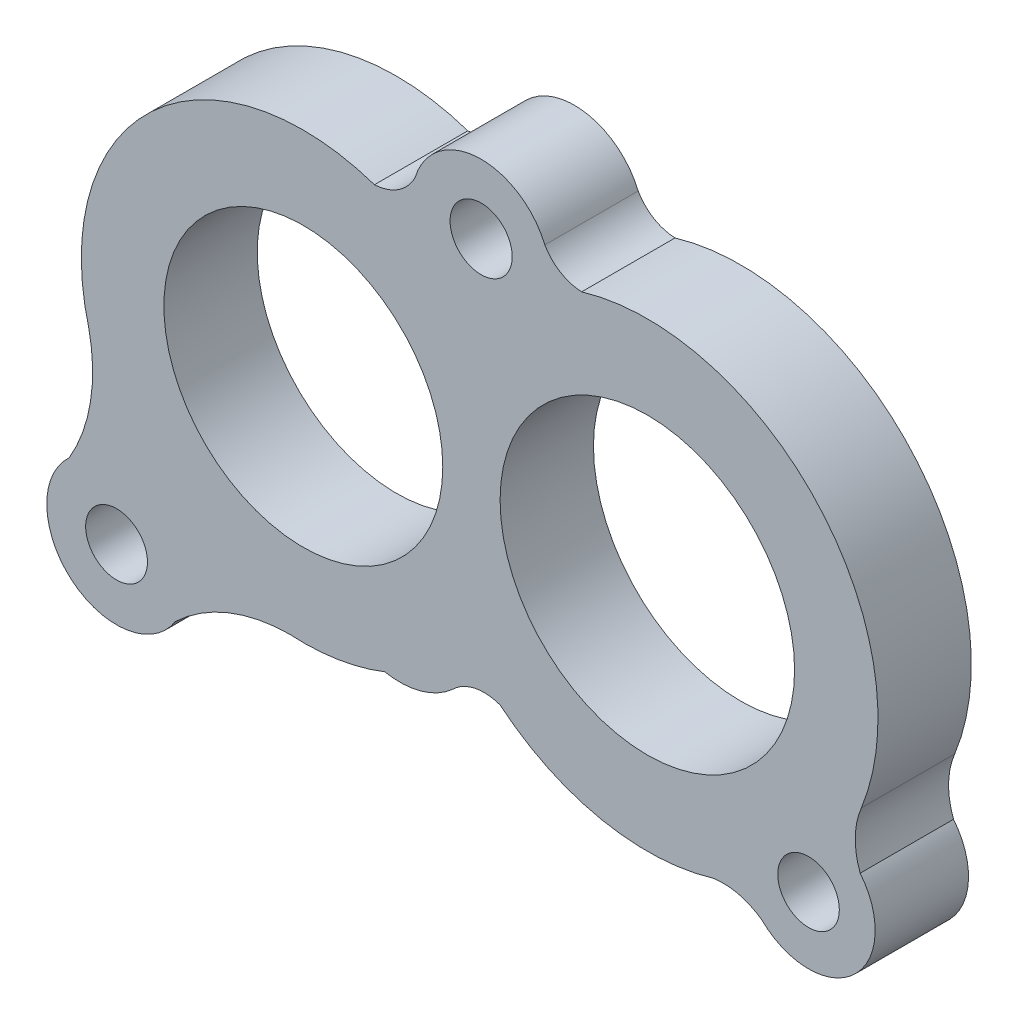
ISO-10303-21;
HEADER;
FILE_DESCRIPTION(('STEP AP214'),'2;1');
FILE_NAME('part.step','',(''),(''),'','','');
FILE_SCHEMA(('AUTOMOTIVE_DESIGN { 1 0 10303 214 1 1 1 1 }'));
ENDSEC;
DATA;
#1=APPLICATION_CONTEXT('core data for automotive mechanical design processes');
#2=APPLICATION_PROTOCOL_DEFINITION('international standard','automotive_design',2000,#1);
#3=PRODUCT_CONTEXT('',#1,'mechanical');
#4=PRODUCT('Part','Part','',(#3));
#5=PRODUCT_RELATED_PRODUCT_CATEGORY('part','',(#4));
#6=PRODUCT_DEFINITION_FORMATION('','',#4);
#7=PRODUCT_DEFINITION_CONTEXT('part definition',#1,'design');
#8=PRODUCT_DEFINITION('design','',#6,#7);
#9=PRODUCT_DEFINITION_SHAPE('','',#8);
#10=(LENGTH_UNIT() NAMED_UNIT(*) SI_UNIT(.MILLI.,.METRE.));
#11=(NAMED_UNIT(*) PLANE_ANGLE_UNIT() SI_UNIT($,.RADIAN.));
#12=(NAMED_UNIT(*) SI_UNIT($,.STERADIAN.) SOLID_ANGLE_UNIT());
#13=UNCERTAINTY_MEASURE_WITH_UNIT(LENGTH_MEASURE(1.E-05),#10,'distance_accuracy_value','');
#14=(GEOMETRIC_REPRESENTATION_CONTEXT(3) GLOBAL_UNCERTAINTY_ASSIGNED_CONTEXT((#13)) GLOBAL_UNIT_ASSIGNED_CONTEXT((#10,
#11,#12)) REPRESENTATION_CONTEXT('',''));
#15=CARTESIAN_POINT('',(0.,0.,0.));
#16=DIRECTION('',(0.,0.,1.));
#17=DIRECTION('',(1.,0.,0.));
#18=AXIS2_PLACEMENT_3D('',#15,#16,#17);
#19=CARTESIAN_POINT('',(1150.32510035845,671.005058170759,10.));
#20=DIRECTION('',(0.,0.,-1.));
#21=DIRECTION('',(-1.,0.,0.));
#22=AXIS2_PLACEMENT_3D('',#19,#20,#21);
#23=CYLINDRICAL_SURFACE('',#22,17.9040012040854);
#24=CARTESIAN_POINT('',(1150.32510035845,671.005058170759,0.));
#25=DIRECTION('',(0.,0.,1.));
#26=DIRECTION('',(1.,0.,0.));
#27=AXIS2_PLACEMENT_3D('',#24,#25,#26);
#28=CIRCLE('',#27,17.9040012040854);
#29=CARTESIAN_POINT('',(1137.98627586492,683.978364196356,0.));
#30=VERTEX_POINT('',#29);
#31=CARTESIAN_POINT('',(1150.19162726811,688.908561851605,0.));
#32=VERTEX_POINT('',#31);
#33=EDGE_CURVE('E201',#30,#32,#28,.F.);
#34=ORIENTED_EDGE('',*,*,#33,.T.);
#35=DIRECTION('',(0.,0.,-1.));
#36=VECTOR('',#35,1.);
#37=CARTESIAN_POINT('',(1150.19162726811,688.908561851605,10.));
#38=LINE('',#37,#36);
#39=CARTESIAN_POINT('',(1150.19162726811,688.908561851605,10.));
#40=VERTEX_POINT('',#39);
#41=EDGE_CURVE('E11',#40,#32,#38,.T.);
#42=ORIENTED_EDGE('',*,*,#41,.F.);
#43=CARTESIAN_POINT('',(1150.32510035845,671.005058170759,10.));
#44=DIRECTION('',(0.,0.,1.));
#45=DIRECTION('',(1.,0.,0.));
#46=AXIS2_PLACEMENT_3D('',#43,#44,#45);
#47=CIRCLE('',#46,17.9040012040854);
#48=CARTESIAN_POINT('',(1137.98627586492,683.978364196356,10.));
#49=VERTEX_POINT('',#48);
#50=EDGE_CURVE('E347',#49,#40,#47,.F.);
#51=ORIENTED_EDGE('',*,*,#50,.F.);
#52=DIRECTION('',(0.,0.,-1.));
#53=VECTOR('',#52,1.);
#54=CARTESIAN_POINT('',(1137.98627586492,683.978364196356,10.));
#55=LINE('',#54,#53);
#56=EDGE_CURVE('E177',#49,#30,#55,.T.);
#57=ORIENTED_EDGE('',*,*,#56,.T.);
#58=EDGE_LOOP('',(#34,#42,#51,#57));
#59=FACE_BOUND('',#58,.T.);
#60=ADVANCED_FACE('F39',(#59),#23,.F.);
#61=CARTESIAN_POINT('',(1151.68513690213,712.630466954228,10.));
#62=DIRECTION('',(0.,0.,-1.));
#63=DIRECTION('',(-1.,0.,0.));
#64=AXIS2_PLACEMENT_3D('',#61,#62,#63);
#65=CYLINDRICAL_SURFACE('',#64,23.7688736107712);
#66=CARTESIAN_POINT('',(1151.68513690213,712.630466954228,0.));
#67=DIRECTION('',(0.,0.,1.));
#68=DIRECTION('',(1.,0.,0.));
#69=AXIS2_PLACEMENT_3D('',#66,#67,#68);
#70=CIRCLE('',#69,23.7688736107712);
#71=CARTESIAN_POINT('',(1160.40529023957,690.518970431006,0.));
#72=VERTEX_POINT('',#71);
#73=EDGE_CURVE('E205',#32,#72,#70,.T.);
#74=ORIENTED_EDGE('',*,*,#73,.T.);
#75=DIRECTION('',(0.,0.,-1.));
#76=VECTOR('',#75,1.);
#77=CARTESIAN_POINT('',(1160.40529023957,690.518970431006,10.));
#78=LINE('',#77,#76);
#79=CARTESIAN_POINT('',(1160.40529023957,690.518970431006,10.));
#80=VERTEX_POINT('',#79);
#81=EDGE_CURVE('E49',#80,#72,#78,.T.);
#82=ORIENTED_EDGE('',*,*,#81,.F.);
#83=CARTESIAN_POINT('',(1151.68513690213,712.630466954228,10.));
#84=DIRECTION('',(0.,0.,1.));
#85=DIRECTION('',(1.,0.,0.));
#86=AXIS2_PLACEMENT_3D('',#83,#84,#85);
#87=CIRCLE('',#86,23.7688736107712);
#88=EDGE_CURVE('E117',#40,#80,#87,.T.);
#89=ORIENTED_EDGE('',*,*,#88,.F.);
#90=ORIENTED_EDGE('',*,*,#41,.T.);
#91=EDGE_LOOP('',(#74,#82,#89,#90));
#92=FACE_BOUND('',#91,.T.);
#93=ADVANCED_FACE('F362',(#92),#65,.T.);
#94=CARTESIAN_POINT('',(1162.02492960815,698.806449295897,10.));
#95=DIRECTION('',(0.,0.,-1.));
#96=DIRECTION('',(-1.,0.,0.));
#97=AXIS2_PLACEMENT_3D('',#94,#95,#96);
#98=CYLINDRICAL_SURFACE('',#97,8.44426063194722);
#99=CARTESIAN_POINT('',(1162.02492960815,698.806449295897,0.));
#100=DIRECTION('',(0.,0.,1.));
#101=DIRECTION('',(1.,0.,0.));
#102=AXIS2_PLACEMENT_3D('',#99,#100,#101);
#103=CIRCLE('',#102,8.44426063194722);
#104=CARTESIAN_POINT('',(1167.67531976915,692.531209965905,0.));
#105=VERTEX_POINT('',#104);
#106=EDGE_CURVE('E208',#72,#105,#103,.T.);
#107=ORIENTED_EDGE('',*,*,#106,.T.);
#108=DIRECTION('',(0.,0.,-1.));
#109=VECTOR('',#108,1.);
#110=CARTESIAN_POINT('',(1167.67531976915,692.531209965905,10.));
#111=LINE('',#110,#109);
#112=CARTESIAN_POINT('',(1167.67531976915,692.531209965905,10.));
#113=VERTEX_POINT('',#112);
#114=EDGE_CURVE('E285',#113,#105,#111,.T.);
#115=ORIENTED_EDGE('',*,*,#114,.F.);
#116=CARTESIAN_POINT('',(1162.02492960815,698.806449295897,10.));
#117=DIRECTION('',(0.,0.,1.));
#118=DIRECTION('',(1.,0.,0.));
#119=AXIS2_PLACEMENT_3D('',#116,#117,#118);
#120=CIRCLE('',#119,8.44426063194722);
#121=EDGE_CURVE('E295',#80,#113,#120,.T.);
#122=ORIENTED_EDGE('',*,*,#121,.F.);
#123=ORIENTED_EDGE('',*,*,#81,.T.);
#124=EDGE_LOOP('',(#107,#115,#122,#123));
#125=FACE_BOUND('',#124,.T.);
#126=ADVANCED_FACE('F293',(#125),#98,.T.);
#127=CARTESIAN_POINT('',(1171.07117350967,689.091245871374,10.));
#128=DIRECTION('',(0.,0.,-1.));
#129=DIRECTION('',(-1.,0.,0.));
#130=AXIS2_PLACEMENT_3D('',#127,#128,#129);
#131=CYLINDRICAL_SURFACE('',#130,4.83375377927274);
#132=CARTESIAN_POINT('',(1171.07117350967,689.091245871374,0.));
#133=DIRECTION('',(0.,0.,1.));
#134=DIRECTION('',(1.,0.,0.));
#135=AXIS2_PLACEMENT_3D('',#132,#133,#134);
#136=CIRCLE('',#135,4.83375377927274);
#137=CARTESIAN_POINT('',(1172.76393969169,693.618907326433,0.));
#138=VERTEX_POINT('',#137);
#139=EDGE_CURVE('E211',#105,#138,#136,.F.);
#140=ORIENTED_EDGE('',*,*,#139,.T.);
#141=DIRECTION('',(0.,0.,-1.));
#142=VECTOR('',#141,1.);
#143=CARTESIAN_POINT('',(1172.76393969169,693.618907326433,10.));
#144=LINE('',#143,#142);
#145=CARTESIAN_POINT('',(1172.76393969169,693.618907326433,10.));
#146=VERTEX_POINT('',#145);
#147=EDGE_CURVE('E281',#146,#138,#144,.T.);
#148=ORIENTED_EDGE('',*,*,#147,.F.);
#149=CARTESIAN_POINT('',(1171.07117350967,689.091245871374,10.));
#150=DIRECTION('',(0.,0.,1.));
#151=DIRECTION('',(1.,0.,0.));
#152=AXIS2_PLACEMENT_3D('',#149,#150,#151);
#153=CIRCLE('',#152,4.83375377927274);
#154=EDGE_CURVE('E314',#113,#146,#153,.F.);
#155=ORIENTED_EDGE('',*,*,#154,.F.);
#156=ORIENTED_EDGE('',*,*,#114,.T.);
#157=EDGE_LOOP('',(#140,#148,#155,#156));
#158=FACE_BOUND('',#157,.T.);
#159=ADVANCED_FACE('F304',(#158),#131,.F.);
#160=CARTESIAN_POINT('',(1188.53901056711,712.636857749028,10.));
#161=DIRECTION('',(0.,0.,-1.));
#162=DIRECTION('',(-1.,0.,0.));
#163=AXIS2_PLACEMENT_3D('',#160,#161,#162);
#164=CYLINDRICAL_SURFACE('',#163,24.7090125136688);
#165=CARTESIAN_POINT('',(1188.53901056711,712.636857749028,0.));
#166=DIRECTION('',(0.,0.,1.));
#167=DIRECTION('',(1.,0.,0.));
#168=AXIS2_PLACEMENT_3D('',#165,#166,#167);
#169=CIRCLE('',#168,24.7090125136688);
#170=CARTESIAN_POINT('',(1195.63007830381,688.967213523689,0.));
#171=VERTEX_POINT('',#170);
#172=EDGE_CURVE('E214',#138,#171,#169,.T.);
#173=ORIENTED_EDGE('',*,*,#172,.T.);
#174=DIRECTION('',(0.,0.,-1.));
#175=VECTOR('',#174,1.);
#176=CARTESIAN_POINT('',(1195.63007830381,688.967213523689,10.));
#177=LINE('',#176,#175);
#178=CARTESIAN_POINT('',(1195.63007830381,688.967213523689,10.));
#179=VERTEX_POINT('',#178);
#180=EDGE_CURVE('E277',#179,#171,#177,.T.);
#181=ORIENTED_EDGE('',*,*,#180,.F.);
#182=CARTESIAN_POINT('',(1188.53901056711,712.636857749028,10.));
#183=DIRECTION('',(0.,0.,1.));
#184=DIRECTION('',(1.,0.,0.));
#185=AXIS2_PLACEMENT_3D('',#182,#183,#184);
#186=CIRCLE('',#185,24.7090125136688);
#187=EDGE_CURVE('E310',#146,#179,#186,.T.);
#188=ORIENTED_EDGE('',*,*,#187,.F.);
#189=ORIENTED_EDGE('',*,*,#147,.T.);
#190=EDGE_LOOP('',(#173,#181,#188,#189));
#191=FACE_BOUND('',#190,.T.);
#192=ADVANCED_FACE('F308',(#191),#164,.T.);
#193=CARTESIAN_POINT('',(1196.66412017446,682.017688146015,10.));
#194=DIRECTION('',(0.,0.,-1.));
#195=DIRECTION('',(-1.,0.,0.));
#196=AXIS2_PLACEMENT_3D('',#193,#194,#195);
#197=CYLINDRICAL_SURFACE('',#196,7.02603341617303);
#198=CARTESIAN_POINT('',(1196.66412017446,682.017688146015,0.));
#199=DIRECTION('',(0.,0.,1.));
#200=DIRECTION('',(1.,0.,0.));
#201=AXIS2_PLACEMENT_3D('',#198,#199,#200);
#202=CIRCLE('',#201,7.02603341617303);
#203=CARTESIAN_POINT('',(1200.81906226093,687.683515695742,0.));
#204=VERTEX_POINT('',#203);
#205=EDGE_CURVE('E217',#171,#204,#202,.F.);
#206=ORIENTED_EDGE('',*,*,#205,.T.);
#207=DIRECTION('',(0.,0.,-1.));
#208=VECTOR('',#207,1.);
#209=CARTESIAN_POINT('',(1200.81906226093,687.683515695742,10.));
#210=LINE('',#209,#208);
#211=CARTESIAN_POINT('',(1200.81906226093,687.683515695742,10.));
#212=VERTEX_POINT('',#211);
#213=EDGE_CURVE('E273',#212,#204,#210,.T.);
#214=ORIENTED_EDGE('',*,*,#213,.F.);
#215=CARTESIAN_POINT('',(1196.66412017446,682.017688146015,10.));
#216=DIRECTION('',(0.,0.,1.));
#217=DIRECTION('',(1.,0.,0.));
#218=AXIS2_PLACEMENT_3D('',#215,#216,#217);
#219=CIRCLE('',#218,7.02603341617303);
#220=EDGE_CURVE('E313',#179,#212,#219,.F.);
#221=ORIENTED_EDGE('',*,*,#220,.F.);
#222=ORIENTED_EDGE('',*,*,#180,.T.);
#223=EDGE_LOOP('',(#206,#214,#221,#222));
#224=FACE_BOUND('',#223,.T.);
#225=ADVANCED_FACE('F515',(#224),#197,.F.);
#226=CARTESIAN_POINT('',(1205.80734896864,692.791475028512,10.));
#227=DIRECTION('',(0.,0.,-1.));
#228=DIRECTION('',(-1.,0.,0.));
#229=AXIS2_PLACEMENT_3D('',#226,#227,#228);
#230=CYLINDRICAL_SURFACE('',#229,7.13962553804877);
#231=CARTESIAN_POINT('',(1205.80734896864,692.791475028512,0.));
#232=DIRECTION('',(0.,0.,1.));
#233=DIRECTION('',(1.,0.,0.));
#234=AXIS2_PLACEMENT_3D('',#231,#232,#233);
#235=CIRCLE('',#234,7.13962553804877);
#236=CARTESIAN_POINT('',(1211.34053526821,697.303470396182,0.));
#237=VERTEX_POINT('',#236);
#238=EDGE_CURVE('E220',#204,#237,#235,.T.);
#239=ORIENTED_EDGE('',*,*,#238,.T.);
#240=DIRECTION('',(0.,0.,-1.));
#241=VECTOR('',#240,1.);
#242=CARTESIAN_POINT('',(1211.34053526821,697.303470396182,10.));
#243=LINE('',#242,#241);
#244=CARTESIAN_POINT('',(1211.34053526821,697.303470396182,10.));
#245=VERTEX_POINT('',#244);
#246=EDGE_CURVE('E270',#245,#237,#243,.T.);
#247=ORIENTED_EDGE('',*,*,#246,.F.);
#248=CARTESIAN_POINT('',(1205.80734896864,692.791475028512,10.));
#249=DIRECTION('',(0.,0.,1.));
#250=DIRECTION('',(1.,0.,0.));
#251=AXIS2_PLACEMENT_3D('',#248,#249,#250);
#252=CIRCLE('',#251,7.13962553804877);
#253=EDGE_CURVE('E318',#212,#245,#252,.T.);
#254=ORIENTED_EDGE('',*,*,#253,.F.);
#255=ORIENTED_EDGE('',*,*,#213,.T.);
#256=EDGE_LOOP('',(#239,#247,#254,#255));
#257=FACE_BOUND('',#256,.T.);
#258=ADVANCED_FACE('F505',(#257),#230,.T.);
#259=CARTESIAN_POINT('',(1219.01373410297,700.207501801095,10.));
#260=DIRECTION('',(0.,0.,-1.));
#261=DIRECTION('',(-1.,0.,0.));
#262=AXIS2_PLACEMENT_3D('',#259,#260,#261);
#263=CYLINDRICAL_SURFACE('',#262,8.20435120887146);
#264=CARTESIAN_POINT('',(1219.01373410297,700.207501801095,0.));
#265=DIRECTION('',(0.,0.,1.));
#266=DIRECTION('',(1.,0.,0.));
#267=AXIS2_PLACEMENT_3D('',#264,#265,#266);
#268=CIRCLE('',#267,8.20435120887146);
#269=CARTESIAN_POINT('',(1211.46742420019,703.426909449982,0.));
#270=VERTEX_POINT('',#269);
#271=EDGE_CURVE('E224',#270,#237,#268,.T.);
#272=ORIENTED_EDGE('',*,*,#271,.F.);
#273=DIRECTION('',(0.,0.,-1.));
#274=VECTOR('',#273,1.);
#275=CARTESIAN_POINT('',(1211.46742420019,703.426909449982,10.));
#276=LINE('',#275,#274);
#277=CARTESIAN_POINT('',(1211.46742420019,703.426909449982,10.));
#278=VERTEX_POINT('',#277);
#279=EDGE_CURVE('E267',#278,#270,#276,.T.);
#280=ORIENTED_EDGE('',*,*,#279,.F.);
#281=CARTESIAN_POINT('',(1219.01373410297,700.207501801095,10.));
#282=DIRECTION('',(0.,0.,1.));
#283=DIRECTION('',(1.,0.,0.));
#284=AXIS2_PLACEMENT_3D('',#281,#282,#283);
#285=CIRCLE('',#284,8.20435120887146);
#286=EDGE_CURVE('E325',#278,#245,#285,.T.);
#287=ORIENTED_EDGE('',*,*,#286,.T.);
#288=ORIENTED_EDGE('',*,*,#246,.T.);
#289=EDGE_LOOP('',(#272,#280,#287,#288));
#290=FACE_BOUND('',#289,.T.);
#291=ADVANCED_FACE('F495',(#290),#263,.F.);
#292=CARTESIAN_POINT('',(1188.53901056711,712.636857749028,10.));
#293=DIRECTION('',(0.,0.,-1.));
#294=DIRECTION('',(-1.,0.,0.));
#295=AXIS2_PLACEMENT_3D('',#292,#293,#294);
#296=CYLINDRICAL_SURFACE('',#295,24.7090125136689);
#297=CARTESIAN_POINT('',(1188.53901056711,712.636857749028,0.));
#298=DIRECTION('',(0.,0.,1.));
#299=DIRECTION('',(1.,0.,0.));
#300=AXIS2_PLACEMENT_3D('',#297,#298,#299);
#301=CIRCLE('',#300,24.7090125136689);
#302=CARTESIAN_POINT('',(1181.50669309383,736.324023268686,0.));
#303=VERTEX_POINT('',#302);
#304=EDGE_CURVE('E228',#270,#303,#301,.T.);
#305=ORIENTED_EDGE('',*,*,#304,.T.);
#306=DIRECTION('',(0.,0.,-1.));
#307=VECTOR('',#306,1.);
#308=CARTESIAN_POINT('',(1181.50669309383,736.324023268686,10.));
#309=LINE('',#308,#307);
#310=CARTESIAN_POINT('',(1181.50669309383,736.324023268686,10.));
#311=VERTEX_POINT('',#310);
#312=EDGE_CURVE('E264',#311,#303,#309,.T.);
#313=ORIENTED_EDGE('',*,*,#312,.F.);
#314=CARTESIAN_POINT('',(1188.53901056711,712.636857749028,10.));
#315=DIRECTION('',(0.,0.,1.));
#316=DIRECTION('',(1.,0.,0.));
#317=AXIS2_PLACEMENT_3D('',#314,#315,#316);
#318=CIRCLE('',#317,24.7090125136689);
#319=EDGE_CURVE('E329',#278,#311,#318,.T.);
#320=ORIENTED_EDGE('',*,*,#319,.F.);
#321=ORIENTED_EDGE('',*,*,#279,.T.);
#322=EDGE_LOOP('',(#305,#313,#320,#321));
#323=FACE_BOUND('',#322,.T.);
#324=ADVANCED_FACE('F485',(#323),#296,.T.);
#325=CARTESIAN_POINT('',(1181.65962833516,741.044686673339,10.));
#326=DIRECTION('',(0.,0.,-1.));
#327=DIRECTION('',(-1.,0.,0.));
#328=AXIS2_PLACEMENT_3D('',#325,#326,#327);
#329=CYLINDRICAL_SURFACE('',#328,4.72314007500074);
#330=CARTESIAN_POINT('',(1181.65962833516,741.044686673339,0.));
#331=DIRECTION('',(0.,0.,1.));
#332=DIRECTION('',(1.,0.,0.));
#333=AXIS2_PLACEMENT_3D('',#330,#331,#332);
#334=CIRCLE('',#333,4.72314007500074);
#335=CARTESIAN_POINT('',(1177.55897741406,738.701032647827,0.));
#336=VERTEX_POINT('',#335);
#337=EDGE_CURVE('E232',#336,#303,#334,.T.);
#338=ORIENTED_EDGE('',*,*,#337,.F.);
#339=DIRECTION('',(0.,0.,-1.));
#340=VECTOR('',#339,1.);
#341=CARTESIAN_POINT('',(1177.55897741406,738.701032647827,10.));
#342=LINE('',#341,#340);
#343=CARTESIAN_POINT('',(1177.55897741406,738.701032647827,10.));
#344=VERTEX_POINT('',#343);
#345=EDGE_CURVE('E261',#344,#336,#342,.T.);
#346=ORIENTED_EDGE('',*,*,#345,.F.);
#347=CARTESIAN_POINT('',(1181.65962833516,741.044686673339,10.));
#348=DIRECTION('',(0.,0.,1.));
#349=DIRECTION('',(1.,0.,0.));
#350=AXIS2_PLACEMENT_3D('',#347,#348,#349);
#351=CIRCLE('',#350,4.72314007500074);
#352=EDGE_CURVE('E332',#344,#311,#351,.T.);
#353=ORIENTED_EDGE('',*,*,#352,.T.);
#354=ORIENTED_EDGE('',*,*,#312,.T.);
#355=EDGE_LOOP('',(#338,#346,#353,#354));
#356=FACE_BOUND('',#355,.T.);
#357=ADVANCED_FACE('F475',(#356),#329,.F.);
#358=CARTESIAN_POINT('',(1170.73289448136,735.852853522064,10.));
#359=DIRECTION('',(0.,0.,-1.));
#360=DIRECTION('',(-1.,0.,0.));
#361=AXIS2_PLACEMENT_3D('',#358,#359,#360);
#362=CYLINDRICAL_SURFACE('',#361,7.39645405153341);
#363=CARTESIAN_POINT('',(1170.73289448136,735.852853522064,0.));
#364=DIRECTION('',(0.,0.,1.));
#365=DIRECTION('',(1.,0.,0.));
#366=AXIS2_PLACEMENT_3D('',#363,#364,#365);
#367=CIRCLE('',#366,7.39645405153341);
#368=CARTESIAN_POINT('',(1163.64359288161,737.962198293356,0.));
#369=VERTEX_POINT('',#368);
#370=EDGE_CURVE('E236',#336,#369,#367,.T.);
#371=ORIENTED_EDGE('',*,*,#370,.T.);
#372=DIRECTION('',(0.,0.,-1.));
#373=VECTOR('',#372,1.);
#374=CARTESIAN_POINT('',(1163.64359288161,737.962198293356,10.));
#375=LINE('',#374,#373);
#376=CARTESIAN_POINT('',(1163.64359288161,737.962198293356,10.));
#377=VERTEX_POINT('',#376);
#378=EDGE_CURVE('E258',#377,#369,#375,.T.);
#379=ORIENTED_EDGE('',*,*,#378,.F.);
#380=CARTESIAN_POINT('',(1170.73289448136,735.852853522064,10.));
#381=DIRECTION('',(0.,0.,1.));
#382=DIRECTION('',(1.,0.,0.));
#383=AXIS2_PLACEMENT_3D('',#380,#381,#382);
#384=CIRCLE('',#383,7.39645405153341);
#385=EDGE_CURVE('E336',#344,#377,#384,.T.);
#386=ORIENTED_EDGE('',*,*,#385,.F.);
#387=ORIENTED_EDGE('',*,*,#345,.T.);
#388=EDGE_LOOP('',(#371,#379,#386,#387));
#389=FACE_BOUND('',#388,.T.);
#390=ADVANCED_FACE('F466',(#389),#362,.T.);
#391=CARTESIAN_POINT('',(1159.05533710948,740.302656156215,10.));
#392=DIRECTION('',(0.,0.,-1.));
#393=DIRECTION('',(-1.,0.,0.));
#394=AXIS2_PLACEMENT_3D('',#391,#392,#393);
#395=CYLINDRICAL_SURFACE('',#394,5.15071199333696);
#396=CARTESIAN_POINT('',(1159.05533710948,740.302656156215,0.));
#397=DIRECTION('',(0.,0.,1.));
#398=DIRECTION('',(1.,0.,0.));
#399=AXIS2_PLACEMENT_3D('',#396,#397,#398);
#400=CIRCLE('',#399,5.15071199333696);
#401=CARTESIAN_POINT('',(1159.30385985549,735.157943289298,0.));
#402=VERTEX_POINT('',#401);
#403=EDGE_CURVE('E240',#402,#369,#400,.T.);
#404=ORIENTED_EDGE('',*,*,#403,.F.);
#405=DIRECTION('',(0.,0.,-1.));
#406=VECTOR('',#405,1.);
#407=CARTESIAN_POINT('',(1159.30385985549,735.157943289298,10.));
#408=LINE('',#407,#406);
#409=CARTESIAN_POINT('',(1159.30385985549,735.157943289298,10.));
#410=VERTEX_POINT('',#409);
#411=EDGE_CURVE('E171',#410,#402,#408,.T.);
#412=ORIENTED_EDGE('',*,*,#411,.F.);
#413=CARTESIAN_POINT('',(1159.05533710948,740.302656156215,10.));
#414=DIRECTION('',(0.,0.,1.));
#415=DIRECTION('',(1.,0.,0.));
#416=AXIS2_PLACEMENT_3D('',#413,#414,#415);
#417=CIRCLE('',#416,5.15071199333696);
#418=EDGE_CURVE('E158',#410,#377,#417,.T.);
#419=ORIENTED_EDGE('',*,*,#418,.T.);
#420=ORIENTED_EDGE('',*,*,#378,.T.);
#421=EDGE_LOOP('',(#404,#412,#419,#420));
#422=FACE_BOUND('',#421,.T.);
#423=ADVANCED_FACE('F341',(#422),#395,.F.);
#424=CARTESIAN_POINT('',(1151.65757854386,712.66521896973,10.));
#425=DIRECTION('',(0.,0.,-1.));
#426=DIRECTION('',(-1.,0.,0.));
#427=AXIS2_PLACEMENT_3D('',#424,#425,#426);
#428=CYLINDRICAL_SURFACE('',#427,23.7568572250781);
#429=CARTESIAN_POINT('',(1151.65757854386,712.66521896973,0.));
#430=DIRECTION('',(0.,0.,1.));
#431=DIRECTION('',(1.,0.,0.));
#432=AXIS2_PLACEMENT_3D('',#429,#430,#431);
#433=CIRCLE('',#432,23.7568572250781);
#434=CARTESIAN_POINT('',(1128.71003829584,706.517157342024,0.));
#435=VERTEX_POINT('',#434);
#436=EDGE_CURVE('E166',#402,#435,#433,.T.);
#437=ORIENTED_EDGE('',*,*,#436,.T.);
#438=DIRECTION('',(0.,0.,-1.));
#439=VECTOR('',#438,1.);
#440=CARTESIAN_POINT('',(1128.71003829584,706.517157342024,10.));
#441=LINE('',#440,#439);
#442=CARTESIAN_POINT('',(1128.71003829584,706.517157342024,10.));
#443=VERTEX_POINT('',#442);
#444=EDGE_CURVE('E163',#443,#435,#441,.T.);
#445=ORIENTED_EDGE('',*,*,#444,.F.);
#446=CARTESIAN_POINT('',(1151.65757854386,712.66521896973,10.));
#447=DIRECTION('',(0.,0.,1.));
#448=DIRECTION('',(1.,0.,0.));
#449=AXIS2_PLACEMENT_3D('',#446,#447,#448);
#450=CIRCLE('',#449,23.7568572250781);
#451=EDGE_CURVE('E152',#410,#443,#450,.T.);
#452=ORIENTED_EDGE('',*,*,#451,.F.);
#453=ORIENTED_EDGE('',*,*,#411,.T.);
#454=EDGE_LOOP('',(#437,#445,#452,#453));
#455=FACE_BOUND('',#454,.T.);
#456=ADVANCED_FACE('F164',(#455),#428,.T.);
#457=CARTESIAN_POINT('',(1110.92903711871,702.702711046443,10.));
#458=DIRECTION('',(0.,0.,-1.));
#459=DIRECTION('',(-1.,0.,0.));
#460=AXIS2_PLACEMENT_3D('',#457,#458,#459);
#461=CYLINDRICAL_SURFACE('',#460,18.185543802779);
#462=CARTESIAN_POINT('',(1110.92903711871,702.702711046443,0.));
#463=DIRECTION('',(0.,0.,1.));
#464=DIRECTION('',(1.,0.,0.));
#465=AXIS2_PLACEMENT_3D('',#462,#463,#464);
#466=CIRCLE('',#465,18.185543802779);
#467=CARTESIAN_POINT('',(1126.59806646984,693.472568978398,0.));
#468=VERTEX_POINT('',#467);
#469=EDGE_CURVE('E246',#468,#435,#466,.T.);
#470=ORIENTED_EDGE('',*,*,#469,.F.);
#471=DIRECTION('',(0.,0.,-1.));
#472=VECTOR('',#471,1.);
#473=CARTESIAN_POINT('',(1126.59806646984,693.472568978398,10.));
#474=LINE('',#473,#472);
#475=CARTESIAN_POINT('',(1126.59806646984,693.472568978398,10.));
#476=VERTEX_POINT('',#475);
#477=EDGE_CURVE('E106',#476,#468,#474,.T.);
#478=ORIENTED_EDGE('',*,*,#477,.F.);
#479=CARTESIAN_POINT('',(1110.92903711871,702.702711046443,10.));
#480=DIRECTION('',(0.,0.,1.));
#481=DIRECTION('',(1.,0.,0.));
#482=AXIS2_PLACEMENT_3D('',#479,#480,#481);
#483=CIRCLE('',#482,18.185543802779);
#484=EDGE_CURVE('E156',#476,#443,#483,.T.);
#485=ORIENTED_EDGE('',*,*,#484,.T.);
#486=ORIENTED_EDGE('',*,*,#444,.T.);
#487=EDGE_LOOP('',(#470,#478,#485,#486));
#488=FACE_BOUND('',#487,.T.);
#489=ADVANCED_FACE('F173',(#488),#461,.F.);
#490=CARTESIAN_POINT('',(1205.80734896864,692.791475028512,10.));
#491=DIRECTION('',(0.,0.,-1.));
#492=DIRECTION('',(-1.,0.,0.));
#493=AXIS2_PLACEMENT_3D('',#490,#491,#492);
#494=CYLINDRICAL_SURFACE('',#493,3.29671881427596);
#495=CARTESIAN_POINT('',(1205.80734896864,692.791475028512,10.));
#496=DIRECTION('',(0.,0.,1.));
#497=DIRECTION('',(1.,0.,0.));
#498=AXIS2_PLACEMENT_3D('',#495,#496,#497);
#499=CIRCLE('',#498,3.29671881427596);
#500=CARTESIAN_POINT('',(1209.10406778292,692.791475028512,10.));
#501=VERTEX_POINT('',#500);
#502=EDGE_CURVE('E591',#501,#501,#499,.T.);
#503=ORIENTED_EDGE('',*,*,#502,.T.);
#504=EDGE_LOOP('',(#503));
#505=FACE_BOUND('',#504,.T.);
#506=CARTESIAN_POINT('',(1205.80734896864,692.791475028512,0.));
#507=DIRECTION('',(0.,0.,1.));
#508=DIRECTION('',(1.,0.,0.));
#509=AXIS2_PLACEMENT_3D('',#506,#507,#508);
#510=CIRCLE('',#509,3.29671881427596);
#511=CARTESIAN_POINT('',(1209.10406778292,692.791475028512,0.));
#512=VERTEX_POINT('',#511);
#513=EDGE_CURVE('E197',#512,#512,#510,.T.);
#514=ORIENTED_EDGE('',*,*,#513,.F.);
#515=EDGE_LOOP('',(#514));
#516=FACE_BOUND('',#515,.T.);
#517=ADVANCED_FACE('F370',(#505,#516),#494,.F.);
#518=CARTESIAN_POINT('',(1170.73289448136,735.852853522064,10.));
#519=DIRECTION('',(0.,0.,-1.));
#520=DIRECTION('',(-1.,0.,0.));
#521=AXIS2_PLACEMENT_3D('',#518,#519,#520);
#522=CYLINDRICAL_SURFACE('',#521,3.32896989568973);
#523=CARTESIAN_POINT('',(1170.73289448136,735.852853522064,10.));
#524=DIRECTION('',(0.,0.,1.));
#525=DIRECTION('',(1.,0.,0.));
#526=AXIS2_PLACEMENT_3D('',#523,#524,#525);
#527=CIRCLE('',#526,3.32896989568973);
#528=CARTESIAN_POINT('',(1174.06186437705,735.852853522064,10.));
#529=VERTEX_POINT('',#528);
#530=EDGE_CURVE('E583',#529,#529,#527,.T.);
#531=ORIENTED_EDGE('',*,*,#530,.T.);
#532=EDGE_LOOP('',(#531));
#533=FACE_BOUND('',#532,.T.);
#534=CARTESIAN_POINT('',(1170.73289448136,735.852853522064,0.));
#535=DIRECTION('',(0.,0.,1.));
#536=DIRECTION('',(1.,0.,0.));
#537=AXIS2_PLACEMENT_3D('',#534,#535,#536);
#538=CIRCLE('',#537,3.32896989568973);
#539=CARTESIAN_POINT('',(1174.06186437705,735.852853522064,0.));
#540=VERTEX_POINT('',#539);
#541=EDGE_CURVE('E193',#540,#540,#538,.T.);
#542=ORIENTED_EDGE('',*,*,#541,.F.);
#543=EDGE_LOOP('',(#542));
#544=FACE_BOUND('',#543,.T.);
#545=ADVANCED_FACE('F373',(#533,#544),#522,.F.);
#546=CARTESIAN_POINT('',(1131.6749373222,687.985100391784,10.));
#547=DIRECTION('',(0.,0.,-1.));
#548=DIRECTION('',(-1.,0.,0.));
#549=AXIS2_PLACEMENT_3D('',#546,#547,#548);
#550=CYLINDRICAL_SURFACE('',#549,3.31072233377022);
#551=CARTESIAN_POINT('',(1131.6749373222,687.985100391784,10.));
#552=DIRECTION('',(0.,0.,1.));
#553=DIRECTION('',(1.,0.,0.));
#554=AXIS2_PLACEMENT_3D('',#551,#552,#553);
#555=CIRCLE('',#554,3.31072233377022);
#556=CARTESIAN_POINT('',(1134.98565965597,687.985100391784,10.));
#557=VERTEX_POINT('',#556);
#558=EDGE_CURVE('E578',#557,#557,#555,.T.);
#559=ORIENTED_EDGE('',*,*,#558,.T.);
#560=EDGE_LOOP('',(#559));
#561=FACE_BOUND('',#560,.T.);
#562=CARTESIAN_POINT('',(1131.6749373222,687.985100391784,0.));
#563=DIRECTION('',(0.,0.,1.));
#564=DIRECTION('',(1.,0.,0.));
#565=AXIS2_PLACEMENT_3D('',#562,#563,#564);
#566=CIRCLE('',#565,3.31072233377022);
#567=CARTESIAN_POINT('',(1134.98565965597,687.985100391784,0.));
#568=VERTEX_POINT('',#567);
#569=EDGE_CURVE('E189',#568,#568,#566,.T.);
#570=ORIENTED_EDGE('',*,*,#569,.F.);
#571=EDGE_LOOP('',(#570));
#572=FACE_BOUND('',#571,.T.);
#573=ADVANCED_FACE('F377',(#561,#572),#550,.F.);
#574=CARTESIAN_POINT('',(1151.68412925279,712.636857749028,10.));
#575=DIRECTION('',(0.,0.,-1.));
#576=DIRECTION('',(-1.,0.,0.));
#577=AXIS2_PLACEMENT_3D('',#574,#575,#576);
#578=CYLINDRICAL_SURFACE('',#577,14.9391831708864);
#579=CARTESIAN_POINT('',(1151.68412925279,712.636857749028,10.));
#580=DIRECTION('',(0.,0.,1.));
#581=DIRECTION('',(1.,0.,0.));
#582=AXIS2_PLACEMENT_3D('',#579,#580,#581);
#583=CIRCLE('',#582,14.9391831708864);
#584=CARTESIAN_POINT('',(1166.62331242368,712.636857749028,10.));
#585=VERTEX_POINT('',#584);
#586=EDGE_CURVE('E388',#585,#585,#583,.T.);
#587=ORIENTED_EDGE('',*,*,#586,.T.);
#588=EDGE_LOOP('',(#587));
#589=FACE_BOUND('',#588,.T.);
#590=CARTESIAN_POINT('',(1151.68412925279,712.636857749028,0.));
#591=DIRECTION('',(0.,0.,1.));
#592=DIRECTION('',(1.,0.,0.));
#593=AXIS2_PLACEMENT_3D('',#590,#591,#592);
#594=CIRCLE('',#593,14.9391831708864);
#595=CARTESIAN_POINT('',(1166.62331242368,712.636857749028,0.));
#596=VERTEX_POINT('',#595);
#597=EDGE_CURVE('E185',#596,#596,#594,.T.);
#598=ORIENTED_EDGE('',*,*,#597,.F.);
#599=EDGE_LOOP('',(#598));
#600=FACE_BOUND('',#599,.T.);
#601=ADVANCED_FACE('F357',(#589,#600),#578,.F.);
#602=CARTESIAN_POINT('',(1188.53901056711,712.636857749028,10.));
#603=DIRECTION('',(0.,0.,-1.));
#604=DIRECTION('',(-1.,0.,0.));
#605=AXIS2_PLACEMENT_3D('',#602,#603,#604);
#606=CYLINDRICAL_SURFACE('',#605,15.7750708754153);
#607=CARTESIAN_POINT('',(1188.53901056711,712.636857749028,10.));
#608=DIRECTION('',(0.,0.,1.));
#609=DIRECTION('',(1.,0.,0.));
#610=AXIS2_PLACEMENT_3D('',#607,#608,#609);
#611=CIRCLE('',#610,15.7750708754153);
#612=CARTESIAN_POINT('',(1204.31408144252,712.636857749028,10.));
#613=VERTEX_POINT('',#612);
#614=EDGE_CURVE('E251',#613,#613,#611,.T.);
#615=ORIENTED_EDGE('',*,*,#614,.T.);
#616=EDGE_LOOP('',(#615));
#617=FACE_BOUND('',#616,.T.);
#618=CARTESIAN_POINT('',(1188.53901056711,712.636857749028,0.));
#619=DIRECTION('',(0.,0.,1.));
#620=DIRECTION('',(1.,0.,0.));
#621=AXIS2_PLACEMENT_3D('',#618,#619,#620);
#622=CIRCLE('',#621,15.7750708754153);
#623=CARTESIAN_POINT('',(1204.31408144252,712.636857749028,0.));
#624=VERTEX_POINT('',#623);
#625=EDGE_CURVE('E181',#624,#624,#622,.T.);
#626=ORIENTED_EDGE('',*,*,#625,.F.);
#627=EDGE_LOOP('',(#626));
#628=FACE_BOUND('',#627,.T.);
#629=ADVANCED_FACE('F41',(#617,#628),#606,.F.);
#630=CARTESIAN_POINT('',(1131.6749373222,687.985100391784,10.));
#631=DIRECTION('',(0.,0.,-1.));
#632=DIRECTION('',(-1.,0.,0.));
#633=AXIS2_PLACEMENT_3D('',#630,#631,#632);
#634=CYLINDRICAL_SURFACE('',#633,7.47575609156575);
#635=CARTESIAN_POINT('',(1131.6749373222,687.985100391784,0.));
#636=DIRECTION('',(0.,0.,1.));
#637=DIRECTION('',(1.,0.,0.));
#638=AXIS2_PLACEMENT_3D('',#635,#636,#637);
#639=CIRCLE('',#638,7.47575609156575);
#640=EDGE_CURVE('E109',#468,#30,#639,.T.);
#641=ORIENTED_EDGE('',*,*,#640,.T.);
#642=ORIENTED_EDGE('',*,*,#56,.F.);
#643=CARTESIAN_POINT('',(1131.6749373222,687.985100391784,10.));
#644=DIRECTION('',(0.,0.,1.));
#645=DIRECTION('',(1.,0.,0.));
#646=AXIS2_PLACEMENT_3D('',#643,#644,#645);
#647=CIRCLE('',#646,7.47575609156575);
#648=EDGE_CURVE('E57',#476,#49,#647,.T.);
#649=ORIENTED_EDGE('',*,*,#648,.F.);
#650=ORIENTED_EDGE('',*,*,#477,.T.);
#651=EDGE_LOOP('',(#641,#642,#649,#650));
#652=FACE_BOUND('',#651,.T.);
#653=ADVANCED_FACE('F348',(#652),#634,.T.);
#654=CARTESIAN_POINT('',(0.,0.,10.));
#655=DIRECTION('',(0.,0.,1.));
#656=DIRECTION('',(1.,0.,0.));
#657=AXIS2_PLACEMENT_3D('',#654,#655,#656);
#658=PLANE('',#657);
#659=ORIENTED_EDGE('',*,*,#614,.F.);
#660=EDGE_LOOP('',(#659));
#661=FACE_BOUND('',#660,.T.);
#662=ORIENTED_EDGE('',*,*,#586,.F.);
#663=EDGE_LOOP('',(#662));
#664=FACE_BOUND('',#663,.T.);
#665=ORIENTED_EDGE('',*,*,#558,.F.);
#666=EDGE_LOOP('',(#665));
#667=FACE_BOUND('',#666,.T.);
#668=ORIENTED_EDGE('',*,*,#530,.F.);
#669=EDGE_LOOP('',(#668));
#670=FACE_BOUND('',#669,.T.);
#671=ORIENTED_EDGE('',*,*,#502,.F.);
#672=EDGE_LOOP('',(#671));
#673=FACE_BOUND('',#672,.T.);
#674=ORIENTED_EDGE('',*,*,#50,.T.);
#675=ORIENTED_EDGE('',*,*,#88,.T.);
#676=ORIENTED_EDGE('',*,*,#121,.T.);
#677=ORIENTED_EDGE('',*,*,#154,.T.);
#678=ORIENTED_EDGE('',*,*,#187,.T.);
#679=ORIENTED_EDGE('',*,*,#220,.T.);
#680=ORIENTED_EDGE('',*,*,#253,.T.);
#681=ORIENTED_EDGE('',*,*,#286,.F.);
#682=ORIENTED_EDGE('',*,*,#319,.T.);
#683=ORIENTED_EDGE('',*,*,#352,.F.);
#684=ORIENTED_EDGE('',*,*,#385,.T.);
#685=ORIENTED_EDGE('',*,*,#418,.F.);
#686=ORIENTED_EDGE('',*,*,#451,.T.);
#687=ORIENTED_EDGE('',*,*,#484,.F.);
#688=ORIENTED_EDGE('',*,*,#648,.T.);
#689=EDGE_LOOP('',(#674,#675,#676,#677,#678,#679,#680,#681,#682,#683,#684,#685,#686,#687,#688));
#690=FACE_BOUND('',#689,.T.);
#691=ADVANCED_FACE('F154',(#661,#664,#667,#670,#673,#690),#658,.T.);
#692=CARTESIAN_POINT('',(0.,0.,0.));
#693=DIRECTION('',(0.,0.,1.));
#694=DIRECTION('',(1.,0.,0.));
#695=AXIS2_PLACEMENT_3D('',#692,#693,#694);
#696=PLANE('',#695);
#697=ORIENTED_EDGE('',*,*,#625,.T.);
#698=EDGE_LOOP('',(#697));
#699=FACE_BOUND('',#698,.T.);
#700=ORIENTED_EDGE('',*,*,#597,.T.);
#701=EDGE_LOOP('',(#700));
#702=FACE_BOUND('',#701,.T.);
#703=ORIENTED_EDGE('',*,*,#569,.T.);
#704=EDGE_LOOP('',(#703));
#705=FACE_BOUND('',#704,.T.);
#706=ORIENTED_EDGE('',*,*,#541,.T.);
#707=EDGE_LOOP('',(#706));
#708=FACE_BOUND('',#707,.T.);
#709=ORIENTED_EDGE('',*,*,#513,.T.);
#710=EDGE_LOOP('',(#709));
#711=FACE_BOUND('',#710,.T.);
#712=ORIENTED_EDGE('',*,*,#33,.F.);
#713=ORIENTED_EDGE('',*,*,#640,.F.);
#714=ORIENTED_EDGE('',*,*,#469,.T.);
#715=ORIENTED_EDGE('',*,*,#436,.F.);
#716=ORIENTED_EDGE('',*,*,#403,.T.);
#717=ORIENTED_EDGE('',*,*,#370,.F.);
#718=ORIENTED_EDGE('',*,*,#337,.T.);
#719=ORIENTED_EDGE('',*,*,#304,.F.);
#720=ORIENTED_EDGE('',*,*,#271,.T.);
#721=ORIENTED_EDGE('',*,*,#238,.F.);
#722=ORIENTED_EDGE('',*,*,#205,.F.);
#723=ORIENTED_EDGE('',*,*,#172,.F.);
#724=ORIENTED_EDGE('',*,*,#139,.F.);
#725=ORIENTED_EDGE('',*,*,#106,.F.);
#726=ORIENTED_EDGE('',*,*,#73,.F.);
#727=EDGE_LOOP('',(#712,#713,#714,#715,#716,#717,#718,#719,#720,#721,#722,#723,#724,#725,#726));
#728=FACE_BOUND('',#727,.T.);
#729=ADVANCED_FACE('F299',(#699,#702,#705,#708,#711,#728),#696,.F.);
#730=CLOSED_SHELL('',(#60,#93,#126,#159,#192,#225,#258,#291,#324,#357,#390,#423,#456,#489,#517,
#545,#573,#601,#629,#653,#691,#729));
#731=MANIFOLD_SOLID_BREP('B2',#730);
#732=ADVANCED_BREP_SHAPE_REPRESENTATION('',(#18,#731),#14);
#733=SHAPE_DEFINITION_REPRESENTATION(#9,#732);
ENDSEC;
END-ISO-10303-21;
